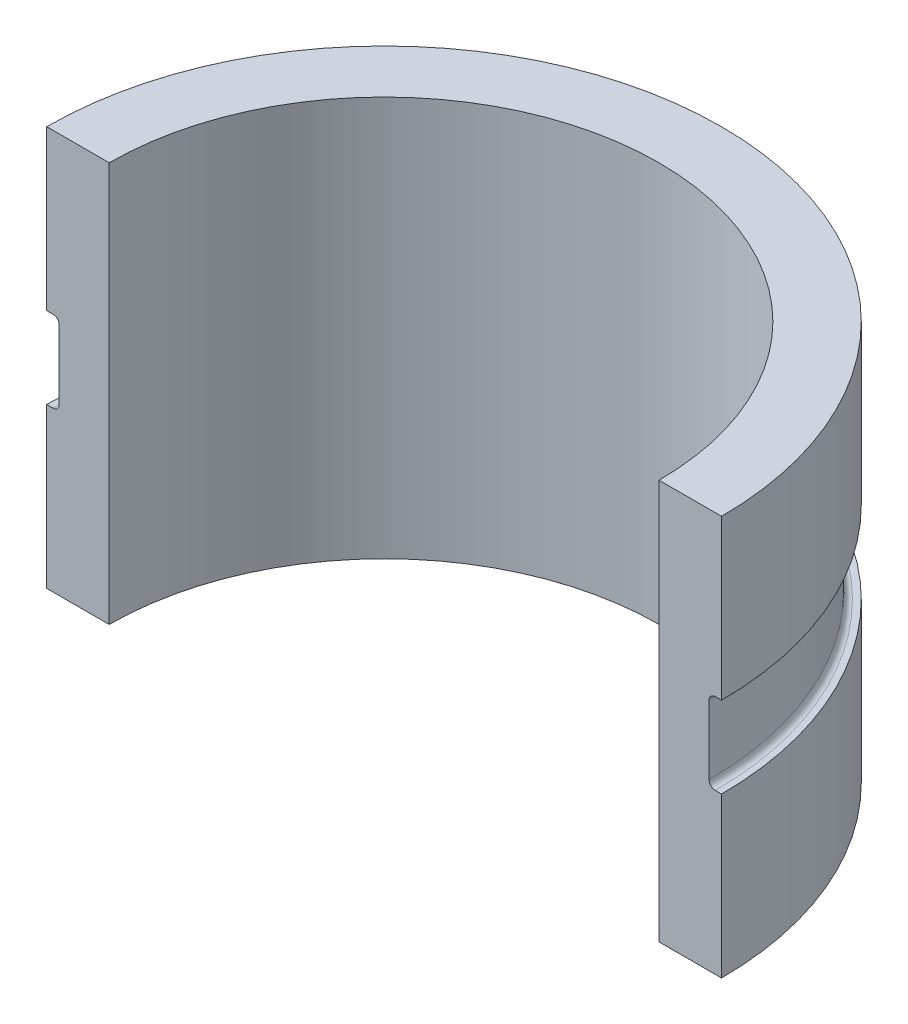
ISO-10303-21;
HEADER;
FILE_DESCRIPTION(('STEP AP214'),'2;1');
FILE_NAME('part.step','',(''),(''),'','','');
FILE_SCHEMA(('AUTOMOTIVE_DESIGN { 1 0 10303 214 1 1 1 1 }'));
ENDSEC;
DATA;
#1=APPLICATION_CONTEXT('core data for automotive mechanical design processes');
#2=APPLICATION_PROTOCOL_DEFINITION('international standard','automotive_design',2000,#1);
#3=PRODUCT_CONTEXT('',#1,'mechanical');
#4=PRODUCT('Part','Part','',(#3));
#5=PRODUCT_RELATED_PRODUCT_CATEGORY('part','',(#4));
#6=PRODUCT_DEFINITION_FORMATION('','',#4);
#7=PRODUCT_DEFINITION_CONTEXT('part definition',#1,'design');
#8=PRODUCT_DEFINITION('design','',#6,#7);
#9=PRODUCT_DEFINITION_SHAPE('','',#8);
#10=(LENGTH_UNIT() NAMED_UNIT(*) SI_UNIT(.MILLI.,.METRE.));
#11=(NAMED_UNIT(*) PLANE_ANGLE_UNIT() SI_UNIT($,.RADIAN.));
#12=(NAMED_UNIT(*) SI_UNIT($,.STERADIAN.) SOLID_ANGLE_UNIT());
#13=UNCERTAINTY_MEASURE_WITH_UNIT(LENGTH_MEASURE(1.E-05),#10,'distance_accuracy_value','');
#14=(GEOMETRIC_REPRESENTATION_CONTEXT(3) GLOBAL_UNCERTAINTY_ASSIGNED_CONTEXT((#13)) GLOBAL_UNIT_ASSIGNED_CONTEXT((#10,
#11,#12)) REPRESENTATION_CONTEXT('',''));
#15=CARTESIAN_POINT('',(0.,0.,0.));
#16=DIRECTION('',(0.,0.,1.));
#17=DIRECTION('',(1.,0.,0.));
#18=AXIS2_PLACEMENT_3D('',#15,#16,#17);
#19=CARTESIAN_POINT('',(0.,81.28,0.));
#20=DIRECTION('',(0.,-1.,0.));
#21=DIRECTION('',(0.,0.,-1.));
#22=AXIS2_PLACEMENT_3D('',#19,#20,#21);
#23=CYLINDRICAL_SURFACE('',#22,68.58);
#24=DIRECTION('',(0.,-1.,0.));
#25=VECTOR('',#24,1.);
#26=CARTESIAN_POINT('',(68.58,81.28,0.));
#27=LINE('',#26,#25);
#28=CARTESIAN_POINT('',(68.58,81.28,0.));
#29=VERTEX_POINT('',#28);
#30=CARTESIAN_POINT('',(68.58,48.895,4.78891580435724E-13));
#31=VERTEX_POINT('',#30);
#32=EDGE_CURVE('E128',#29,#31,#27,.T.);
#33=ORIENTED_EDGE('',*,*,#32,.T.);
#34=CARTESIAN_POINT('',(0.,48.895,0.));
#35=DIRECTION('',(0.,1.,0.));
#36=DIRECTION('',(0.,0.,1.));
#37=AXIS2_PLACEMENT_3D('',#34,#35,#36);
#38=CIRCLE('',#37,68.58);
#39=CARTESIAN_POINT('',(-68.58,48.895,0.));
#40=VERTEX_POINT('',#39);
#41=EDGE_CURVE('E114',#31,#40,#38,.T.);
#42=ORIENTED_EDGE('',*,*,#41,.T.);
#43=DIRECTION('',(0.,-1.,0.));
#44=VECTOR('',#43,1.);
#45=CARTESIAN_POINT('',(-68.58,81.28,0.));
#46=LINE('',#45,#44);
#47=CARTESIAN_POINT('',(-68.58,81.28,0.));
#48=VERTEX_POINT('',#47);
#49=EDGE_CURVE('E125',#48,#40,#46,.T.);
#50=ORIENTED_EDGE('',*,*,#49,.F.);
#51=CARTESIAN_POINT('',(0.,81.28,0.));
#52=DIRECTION('',(0.,1.,0.));
#53=DIRECTION('',(0.,0.,-1.));
#54=AXIS2_PLACEMENT_3D('',#51,#52,#53);
#55=CIRCLE('',#54,68.58);
#56=EDGE_CURVE('E184',#29,#48,#55,.T.);
#57=ORIENTED_EDGE('',*,*,#56,.F.);
#58=EDGE_LOOP('',(#33,#42,#50,#57));
#59=FACE_BOUND('',#58,.T.);
#60=ADVANCED_FACE('F33',(#59),#23,.T.);
#61=CARTESIAN_POINT('',(0.,81.28,0.));
#62=DIRECTION('',(0.,-1.,0.));
#63=DIRECTION('',(0.,0.,-1.));
#64=AXIS2_PLACEMENT_3D('',#61,#62,#63);
#65=CYLINDRICAL_SURFACE('',#64,55.88);
#66=CARTESIAN_POINT('',(0.,0.,0.));
#67=DIRECTION('',(0.,-1.,0.));
#68=DIRECTION('',(0.,0.,-1.));
#69=AXIS2_PLACEMENT_3D('',#66,#67,#68);
#70=CIRCLE('',#69,55.88);
#71=CARTESIAN_POINT('',(-55.88,0.,0.));
#72=VERTEX_POINT('',#71);
#73=CARTESIAN_POINT('',(55.88,0.,0.));
#74=VERTEX_POINT('',#73);
#75=EDGE_CURVE('E129',#72,#74,#70,.T.);
#76=ORIENTED_EDGE('',*,*,#75,.T.);
#77=DIRECTION('',(0.,-1.,0.));
#78=VECTOR('',#77,1.);
#79=CARTESIAN_POINT('',(55.88,81.28,0.));
#80=LINE('',#79,#78);
#81=CARTESIAN_POINT('',(55.88,81.28,0.));
#82=VERTEX_POINT('',#81);
#83=EDGE_CURVE('E143',#82,#74,#80,.T.);
#84=ORIENTED_EDGE('',*,*,#83,.F.);
#85=CARTESIAN_POINT('',(0.,81.28,0.));
#86=DIRECTION('',(0.,-1.,0.));
#87=DIRECTION('',(0.,0.,-1.));
#88=AXIS2_PLACEMENT_3D('',#85,#86,#87);
#89=CIRCLE('',#88,55.88);
#90=CARTESIAN_POINT('',(-55.88,81.28,0.));
#91=VERTEX_POINT('',#90);
#92=EDGE_CURVE('E178',#91,#82,#89,.T.);
#93=ORIENTED_EDGE('',*,*,#92,.F.);
#94=DIRECTION('',(0.,-1.,0.));
#95=VECTOR('',#94,1.);
#96=CARTESIAN_POINT('',(-55.88,81.28,0.));
#97=LINE('',#96,#95);
#98=EDGE_CURVE('E139',#91,#72,#97,.T.);
#99=ORIENTED_EDGE('',*,*,#98,.T.);
#100=EDGE_LOOP('',(#76,#84,#93,#99));
#101=FACE_BOUND('',#100,.T.);
#102=ADVANCED_FACE('F202',(#101),#65,.F.);
#103=CARTESIAN_POINT('',(55.88,81.28,0.));
#104=DIRECTION('',(0.,0.,-1.));
#105=DIRECTION('',(-1.,0.,0.));
#106=AXIS2_PLACEMENT_3D('',#103,#104,#105);
#107=PLANE('',#106);
#108=DIRECTION('',(-1.,0.,0.));
#109=VECTOR('',#108,1.);
#110=CARTESIAN_POINT('',(66.04,32.385,4.61154855234401E-13));
#111=LINE('',#110,#109);
#112=CARTESIAN_POINT('',(68.58,32.385,4.78891580435724E-13));
#113=VERTEX_POINT('',#112);
#114=CARTESIAN_POINT('',(67.31,32.385,4.70023217835063E-13));
#115=VERTEX_POINT('',#114);
#116=EDGE_CURVE('E119',#113,#115,#111,.T.);
#117=ORIENTED_EDGE('',*,*,#116,.T.);
#118=CARTESIAN_POINT('',(67.31,33.655,0.));
#119=DIRECTION('',(0.,0.,-1.));
#120=DIRECTION('',(-1.,0.,0.));
#121=AXIS2_PLACEMENT_3D('',#118,#119,#120);
#122=CIRCLE('',#121,1.27);
#123=CARTESIAN_POINT('',(66.04,33.655,4.61154855234401E-13));
#124=VERTEX_POINT('',#123);
#125=EDGE_CURVE('E11',#115,#124,#122,.T.);
#126=ORIENTED_EDGE('',*,*,#125,.T.);
#127=DIRECTION('',(0.,1.,0.));
#128=VECTOR('',#127,1.);
#129=CARTESIAN_POINT('',(66.04,48.895,4.61154855234401E-13));
#130=LINE('',#129,#128);
#131=CARTESIAN_POINT('',(66.04,47.625,4.61154855234401E-13));
#132=VERTEX_POINT('',#131);
#133=EDGE_CURVE('E162',#124,#132,#130,.T.);
#134=ORIENTED_EDGE('',*,*,#133,.T.);
#135=CARTESIAN_POINT('',(67.31,47.625,0.));
#136=DIRECTION('',(0.,0.,-1.));
#137=DIRECTION('',(-1.,0.,0.));
#138=AXIS2_PLACEMENT_3D('',#135,#136,#137);
#139=CIRCLE('',#138,1.27);
#140=CARTESIAN_POINT('',(67.31,48.895,4.70023217835063E-13));
#141=VERTEX_POINT('',#140);
#142=EDGE_CURVE('E155',#132,#141,#139,.T.);
#143=ORIENTED_EDGE('',*,*,#142,.T.);
#144=DIRECTION('',(1.,0.,0.));
#145=VECTOR('',#144,1.);
#146=CARTESIAN_POINT('',(68.58,48.895,4.78891580435724E-13));
#147=LINE('',#146,#145);
#148=EDGE_CURVE('E160',#141,#31,#147,.T.);
#149=ORIENTED_EDGE('',*,*,#148,.T.);
#150=ORIENTED_EDGE('',*,*,#32,.F.);
#151=DIRECTION('',(1.,0.,0.));
#152=VECTOR('',#151,1.);
#153=CARTESIAN_POINT('',(55.88,81.28,0.));
#154=LINE('',#153,#152);
#155=EDGE_CURVE('E181',#82,#29,#154,.T.);
#156=ORIENTED_EDGE('',*,*,#155,.F.);
#157=ORIENTED_EDGE('',*,*,#83,.T.);
#158=DIRECTION('',(1.,0.,0.));
#159=VECTOR('',#158,1.);
#160=CARTESIAN_POINT('',(55.88,0.,0.));
#161=LINE('',#160,#159);
#162=CARTESIAN_POINT('',(68.58,0.,0.));
#163=VERTEX_POINT('',#162);
#164=EDGE_CURVE('E189',#74,#163,#161,.T.);
#165=ORIENTED_EDGE('',*,*,#164,.T.);
#166=EDGE_CURVE('E135',#113,#163,#27,.T.);
#167=ORIENTED_EDGE('',*,*,#166,.F.);
#168=EDGE_LOOP('',(#117,#126,#134,#143,#149,#150,#156,#157,#165,#167));
#169=FACE_BOUND('',#168,.T.);
#170=ADVANCED_FACE('F159',(#169),#107,.F.);
#171=CARTESIAN_POINT('',(-68.58,32.385,0.));
#172=VERTEX_POINT('',#171);
#173=CARTESIAN_POINT('',(-68.58,0.,0.));
#174=VERTEX_POINT('',#173);
#175=EDGE_CURVE('E136',#172,#174,#46,.T.);
#176=ORIENTED_EDGE('',*,*,#175,.F.);
#177=CARTESIAN_POINT('',(0.,32.385,0.));
#178=DIRECTION('',(0.,1.,0.));
#179=DIRECTION('',(0.,0.,1.));
#180=AXIS2_PLACEMENT_3D('',#177,#178,#179);
#181=CIRCLE('',#180,68.58);
#182=EDGE_CURVE('E130',#113,#172,#181,.T.);
#183=ORIENTED_EDGE('',*,*,#182,.F.);
#184=ORIENTED_EDGE('',*,*,#166,.T.);
#185=CARTESIAN_POINT('',(0.,0.,0.));
#186=DIRECTION('',(0.,1.,0.));
#187=DIRECTION('',(0.,0.,-1.));
#188=AXIS2_PLACEMENT_3D('',#185,#186,#187);
#189=CIRCLE('',#188,68.58);
#190=EDGE_CURVE('E192',#163,#174,#189,.T.);
#191=ORIENTED_EDGE('',*,*,#190,.T.);
#192=EDGE_LOOP('',(#176,#183,#184,#191));
#193=FACE_BOUND('',#192,.T.);
#194=ADVANCED_FACE('F215',(#193),#23,.T.);
#195=CARTESIAN_POINT('',(-68.58,81.28,0.));
#196=DIRECTION('',(0.,0.,-1.));
#197=DIRECTION('',(-1.,0.,0.));
#198=AXIS2_PLACEMENT_3D('',#195,#196,#197);
#199=PLANE('',#198);
#200=ORIENTED_EDGE('',*,*,#49,.T.);
#201=DIRECTION('',(-1.,0.,0.));
#202=VECTOR('',#201,1.);
#203=CARTESIAN_POINT('',(-68.58,48.895,0.));
#204=LINE('',#203,#202);
#205=CARTESIAN_POINT('',(-67.31,48.895,0.));
#206=VERTEX_POINT('',#205);
#207=EDGE_CURVE('E110',#206,#40,#204,.T.);
#208=ORIENTED_EDGE('',*,*,#207,.F.);
#209=CARTESIAN_POINT('',(-67.31,47.625,0.));
#210=DIRECTION('',(0.,0.,-1.));
#211=DIRECTION('',(-1.,0.,0.));
#212=AXIS2_PLACEMENT_3D('',#209,#210,#211);
#213=CIRCLE('',#212,1.27);
#214=CARTESIAN_POINT('',(-66.04,47.625,0.));
#215=VERTEX_POINT('',#214);
#216=EDGE_CURVE('E153',#206,#215,#213,.T.);
#217=ORIENTED_EDGE('',*,*,#216,.T.);
#218=DIRECTION('',(0.,1.,0.));
#219=VECTOR('',#218,1.);
#220=CARTESIAN_POINT('',(-66.04,48.895,0.));
#221=LINE('',#220,#219);
#222=CARTESIAN_POINT('',(-66.04,33.655,0.));
#223=VERTEX_POINT('',#222);
#224=EDGE_CURVE('E120',#223,#215,#221,.T.);
#225=ORIENTED_EDGE('',*,*,#224,.F.);
#226=CARTESIAN_POINT('',(-67.31,33.655,0.));
#227=DIRECTION('',(0.,0.,-1.));
#228=DIRECTION('',(-1.,0.,0.));
#229=AXIS2_PLACEMENT_3D('',#226,#227,#228);
#230=CIRCLE('',#229,1.27);
#231=CARTESIAN_POINT('',(-67.31,32.385,0.));
#232=VERTEX_POINT('',#231);
#233=EDGE_CURVE('E41',#223,#232,#230,.T.);
#234=ORIENTED_EDGE('',*,*,#233,.T.);
#235=DIRECTION('',(1.,0.,0.));
#236=VECTOR('',#235,1.);
#237=CARTESIAN_POINT('',(-66.04,32.385,0.));
#238=LINE('',#237,#236);
#239=EDGE_CURVE('E171',#172,#232,#238,.T.);
#240=ORIENTED_EDGE('',*,*,#239,.F.);
#241=ORIENTED_EDGE('',*,*,#175,.T.);
#242=DIRECTION('',(1.,0.,0.));
#243=VECTOR('',#242,1.);
#244=CARTESIAN_POINT('',(-68.58,0.,0.));
#245=LINE('',#244,#243);
#246=EDGE_CURVE('E182',#174,#72,#245,.T.);
#247=ORIENTED_EDGE('',*,*,#246,.T.);
#248=ORIENTED_EDGE('',*,*,#98,.F.);
#249=DIRECTION('',(1.,0.,0.));
#250=VECTOR('',#249,1.);
#251=CARTESIAN_POINT('',(-68.58,81.28,0.));
#252=LINE('',#251,#250);
#253=EDGE_CURVE('E134',#48,#91,#252,.T.);
#254=ORIENTED_EDGE('',*,*,#253,.F.);
#255=EDGE_LOOP('',(#200,#208,#217,#225,#234,#240,#241,#247,#248,#254));
#256=FACE_BOUND('',#255,.T.);
#257=ADVANCED_FACE('F132',(#256),#199,.F.);
#258=CARTESIAN_POINT('',(0.,81.28,0.));
#259=DIRECTION('',(0.,-1.,0.));
#260=DIRECTION('',(0.,0.,-1.));
#261=AXIS2_PLACEMENT_3D('',#258,#259,#260);
#262=PLANE('',#261);
#263=ORIENTED_EDGE('',*,*,#92,.T.);
#264=ORIENTED_EDGE('',*,*,#155,.T.);
#265=ORIENTED_EDGE('',*,*,#56,.T.);
#266=ORIENTED_EDGE('',*,*,#253,.T.);
#267=EDGE_LOOP('',(#263,#264,#265,#266));
#268=FACE_BOUND('',#267,.T.);
#269=ADVANCED_FACE('F207',(#268),#262,.F.);
#270=CARTESIAN_POINT('',(0.,0.,0.));
#271=DIRECTION('',(0.,-1.,0.));
#272=DIRECTION('',(0.,0.,-1.));
#273=AXIS2_PLACEMENT_3D('',#270,#271,#272);
#274=PLANE('',#273);
#275=ORIENTED_EDGE('',*,*,#75,.F.);
#276=ORIENTED_EDGE('',*,*,#246,.F.);
#277=ORIENTED_EDGE('',*,*,#190,.F.);
#278=ORIENTED_EDGE('',*,*,#164,.F.);
#279=EDGE_LOOP('',(#275,#276,#277,#278));
#280=FACE_BOUND('',#279,.T.);
#281=ADVANCED_FACE('F204',(#280),#274,.T.);
#282=CARTESIAN_POINT('',(68.58,48.895,4.78891580435724E-13));
#283=DIRECTION('',(0.,1.,0.));
#284=DIRECTION('',(0.,0.,1.));
#285=AXIS2_PLACEMENT_3D('',#282,#283,#284);
#286=PLANE('',#285);
#287=ORIENTED_EDGE('',*,*,#148,.F.);
#288=CARTESIAN_POINT('',(0.,48.895,0.));
#289=DIRECTION('',(0.,1.,0.));
#290=DIRECTION('',(0.,0.,1.));
#291=AXIS2_PLACEMENT_3D('',#288,#289,#290);
#292=CIRCLE('',#291,67.31);
#293=EDGE_CURVE('E117',#141,#206,#292,.T.);
#294=ORIENTED_EDGE('',*,*,#293,.T.);
#295=ORIENTED_EDGE('',*,*,#207,.T.);
#296=ORIENTED_EDGE('',*,*,#41,.F.);
#297=EDGE_LOOP('',(#287,#294,#295,#296));
#298=FACE_BOUND('',#297,.T.);
#299=ADVANCED_FACE('F113',(#298),#286,.F.);
#300=CARTESIAN_POINT('',(0.,81.28,0.));
#301=DIRECTION('',(0.,1.,0.));
#302=DIRECTION('',(0.,0.,1.));
#303=AXIS2_PLACEMENT_3D('',#300,#301,#302);
#304=CYLINDRICAL_SURFACE('',#303,66.04);
#305=ORIENTED_EDGE('',*,*,#224,.T.);
#306=CARTESIAN_POINT('',(0.,47.625,0.));
#307=DIRECTION('',(0.,1.,0.));
#308=DIRECTION('',(0.,0.,1.));
#309=AXIS2_PLACEMENT_3D('',#306,#307,#308);
#310=CIRCLE('',#309,66.04);
#311=EDGE_CURVE('E150',#215,#132,#310,.F.);
#312=ORIENTED_EDGE('',*,*,#311,.T.);
#313=ORIENTED_EDGE('',*,*,#133,.F.);
#314=CARTESIAN_POINT('',(0.,33.655,0.));
#315=DIRECTION('',(0.,-1.,0.));
#316=DIRECTION('',(0.,0.,-1.));
#317=AXIS2_PLACEMENT_3D('',#314,#315,#316);
#318=CIRCLE('',#317,66.04);
#319=EDGE_CURVE('E147',#124,#223,#318,.F.);
#320=ORIENTED_EDGE('',*,*,#319,.T.);
#321=EDGE_LOOP('',(#305,#312,#313,#320));
#322=FACE_BOUND('',#321,.T.);
#323=ADVANCED_FACE('F169',(#322),#304,.T.);
#324=CARTESIAN_POINT('',(66.04,32.385,4.61154855234401E-13));
#325=DIRECTION('',(0.,-1.,0.));
#326=DIRECTION('',(0.,0.,-1.));
#327=AXIS2_PLACEMENT_3D('',#324,#325,#326);
#328=PLANE('',#327);
#329=ORIENTED_EDGE('',*,*,#239,.T.);
#330=CARTESIAN_POINT('',(0.,32.385,0.));
#331=DIRECTION('',(0.,-1.,0.));
#332=DIRECTION('',(0.,0.,-1.));
#333=AXIS2_PLACEMENT_3D('',#330,#331,#332);
#334=CIRCLE('',#333,67.31);
#335=EDGE_CURVE('E54',#232,#115,#334,.T.);
#336=ORIENTED_EDGE('',*,*,#335,.T.);
#337=ORIENTED_EDGE('',*,*,#116,.F.);
#338=ORIENTED_EDGE('',*,*,#182,.T.);
#339=EDGE_LOOP('',(#329,#336,#337,#338));
#340=FACE_BOUND('',#339,.T.);
#341=ADVANCED_FACE('F237',(#340),#328,.F.);
#342=CARTESIAN_POINT('',(0.,47.625,0.));
#343=DIRECTION('',(0.,1.,0.));
#344=DIRECTION('',(0.,0.,1.));
#345=AXIS2_PLACEMENT_3D('',#342,#343,#344);
#346=TOROIDAL_SURFACE('',#345,67.31,1.27);
#347=ORIENTED_EDGE('',*,*,#142,.F.);
#348=ORIENTED_EDGE('',*,*,#311,.F.);
#349=ORIENTED_EDGE('',*,*,#216,.F.);
#350=ORIENTED_EDGE('',*,*,#293,.F.);
#351=EDGE_LOOP('',(#347,#348,#349,#350));
#352=FACE_BOUND('',#351,.T.);
#353=ADVANCED_FACE('F166',(#352),#346,.F.);
#354=CARTESIAN_POINT('',(0.,33.655,0.));
#355=DIRECTION('',(0.,-1.,0.));
#356=DIRECTION('',(0.,0.,-1.));
#357=AXIS2_PLACEMENT_3D('',#354,#355,#356);
#358=TOROIDAL_SURFACE('',#357,67.31,1.27);
#359=ORIENTED_EDGE('',*,*,#125,.F.);
#360=ORIENTED_EDGE('',*,*,#335,.F.);
#361=ORIENTED_EDGE('',*,*,#233,.F.);
#362=ORIENTED_EDGE('',*,*,#319,.F.);
#363=EDGE_LOOP('',(#359,#360,#361,#362));
#364=FACE_BOUND('',#363,.T.);
#365=ADVANCED_FACE('F35',(#364),#358,.F.);
#366=CLOSED_SHELL('',(#60,#102,#170,#194,#257,#269,#281,#299,#323,#341,#353,#365));
#367=MANIFOLD_SOLID_BREP('B2',#366);
#368=ADVANCED_BREP_SHAPE_REPRESENTATION('',(#18,#367),#14);
#369=SHAPE_DEFINITION_REPRESENTATION(#9,#368);
ENDSEC;
END-ISO-10303-21;
